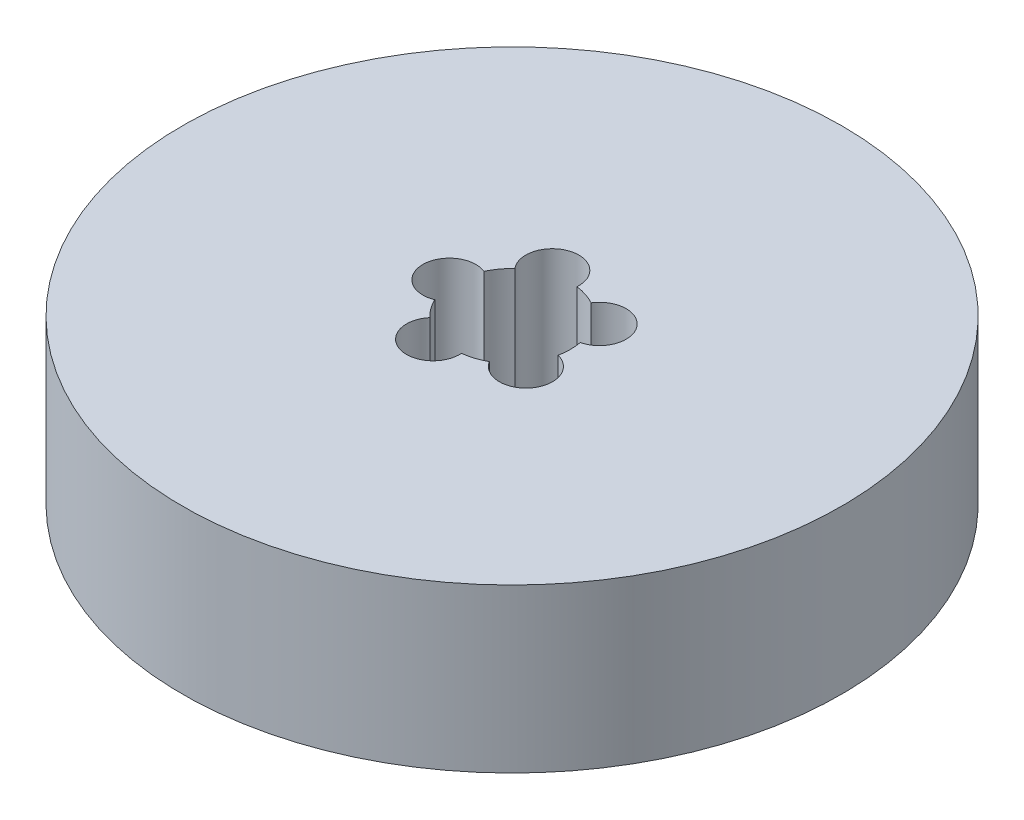
ISO-10303-21;
HEADER;
FILE_DESCRIPTION(('STEP AP214'),'2;1');
FILE_NAME('part.step','',(''),(''),'','','');
FILE_SCHEMA(('AUTOMOTIVE_DESIGN { 1 0 10303 214 1 1 1 1 }'));
ENDSEC;
DATA;
#1=APPLICATION_CONTEXT('core data for automotive mechanical design processes');
#2=APPLICATION_PROTOCOL_DEFINITION('international standard','automotive_design',2000,#1);
#3=PRODUCT_CONTEXT('',#1,'mechanical');
#4=PRODUCT('Part','Part','',(#3));
#5=PRODUCT_RELATED_PRODUCT_CATEGORY('part','',(#4));
#6=PRODUCT_DEFINITION_FORMATION('','',#4);
#7=PRODUCT_DEFINITION_CONTEXT('part definition',#1,'design');
#8=PRODUCT_DEFINITION('design','',#6,#7);
#9=PRODUCT_DEFINITION_SHAPE('','',#8);
#10=(LENGTH_UNIT() NAMED_UNIT(*) SI_UNIT(.MILLI.,.METRE.));
#11=(NAMED_UNIT(*) PLANE_ANGLE_UNIT() SI_UNIT($,.RADIAN.));
#12=(NAMED_UNIT(*) SI_UNIT($,.STERADIAN.) SOLID_ANGLE_UNIT());
#13=UNCERTAINTY_MEASURE_WITH_UNIT(LENGTH_MEASURE(1.E-05),#10,'distance_accuracy_value','');
#14=(GEOMETRIC_REPRESENTATION_CONTEXT(3) GLOBAL_UNCERTAINTY_ASSIGNED_CONTEXT((#13)) GLOBAL_UNIT_ASSIGNED_CONTEXT((#10,
#11,#12)) REPRESENTATION_CONTEXT('',''));
#15=CARTESIAN_POINT('',(0.,0.,0.));
#16=DIRECTION('',(0.,0.,1.));
#17=DIRECTION('',(1.,0.,0.));
#18=AXIS2_PLACEMENT_3D('',#15,#16,#17);
#19=CARTESIAN_POINT('',(0.,21.,0.));
#20=DIRECTION('',(0.,-1.,0.));
#21=DIRECTION('',(0.,0.,-1.));
#22=AXIS2_PLACEMENT_3D('',#19,#20,#21);
#23=CYLINDRICAL_SURFACE('',#22,42.5);
#24=CARTESIAN_POINT('',(0.,21.,0.));
#25=DIRECTION('',(0.,1.,0.));
#26=DIRECTION('',(0.,0.,1.));
#27=AXIS2_PLACEMENT_3D('',#24,#25,#26);
#28=CIRCLE('',#27,42.5);
#29=CARTESIAN_POINT('',(0.,21.,-42.5));
#30=VERTEX_POINT('',#29);
#31=EDGE_CURVE('E157',#30,#30,#28,.T.);
#32=CARTESIAN_POINT('',(0.,0.,0.));
#33=DIRECTION('',(0.,1.,0.));
#34=DIRECTION('',(0.,0.,1.));
#35=AXIS2_PLACEMENT_3D('',#32,#33,#34);
#36=CIRCLE('',#35,42.5);
#37=CARTESIAN_POINT('',(0.,0.,-42.5));
#38=VERTEX_POINT('',#37);
#39=EDGE_CURVE('E150',#38,#38,#36,.T.);
#40=CARTESIAN_POINT('',(0.,21.,-42.5));
#41=CARTESIAN_POINT('',(0.,20.78125,-42.5));
#42=CARTESIAN_POINT('',(0.,20.5625,-42.5));
#43=CARTESIAN_POINT('',(0.,20.125,-42.5));
#44=CARTESIAN_POINT('',(0.,19.90625,-42.5));
#45=CARTESIAN_POINT('',(0.,19.46875,-42.5));
#46=CARTESIAN_POINT('',(0.,19.25,-42.5));
#47=CARTESIAN_POINT('',(0.,18.8125,-42.5));
#48=CARTESIAN_POINT('',(0.,18.59375,-42.5));
#49=CARTESIAN_POINT('',(0.,18.15625,-42.5));
#50=CARTESIAN_POINT('',(0.,17.9375,-42.5));
#51=CARTESIAN_POINT('',(0.,17.5,-42.5));
#52=CARTESIAN_POINT('',(0.,17.28125,-42.5));
#53=CARTESIAN_POINT('',(0.,16.84375,-42.5));
#54=CARTESIAN_POINT('',(0.,16.625,-42.5));
#55=CARTESIAN_POINT('',(0.,16.1875,-42.5));
#56=CARTESIAN_POINT('',(0.,15.96875,-42.5));
#57=CARTESIAN_POINT('',(0.,15.53125,-42.5));
#58=CARTESIAN_POINT('',(0.,15.3125,-42.5));
#59=CARTESIAN_POINT('',(0.,14.875,-42.5));
#60=CARTESIAN_POINT('',(0.,14.65625,-42.5));
#61=CARTESIAN_POINT('',(0.,14.21875,-42.5));
#62=CARTESIAN_POINT('',(0.,14.,-42.5));
#63=CARTESIAN_POINT('',(0.,13.5625,-42.5));
#64=CARTESIAN_POINT('',(0.,13.34375,-42.5));
#65=CARTESIAN_POINT('',(0.,12.90625,-42.5));
#66=CARTESIAN_POINT('',(0.,12.6875,-42.5));
#67=CARTESIAN_POINT('',(0.,12.25,-42.5));
#68=CARTESIAN_POINT('',(0.,12.03125,-42.5));
#69=CARTESIAN_POINT('',(0.,11.59375,-42.5));
#70=CARTESIAN_POINT('',(0.,11.375,-42.5));
#71=CARTESIAN_POINT('',(0.,10.9375,-42.5));
#72=CARTESIAN_POINT('',(0.,10.71875,-42.5));
#73=CARTESIAN_POINT('',(0.,10.28125,-42.5));
#74=CARTESIAN_POINT('',(0.,10.0625,-42.5));
#75=CARTESIAN_POINT('',(0.,9.625,-42.5));
#76=CARTESIAN_POINT('',(0.,9.40625,-42.5));
#77=CARTESIAN_POINT('',(0.,8.96875,-42.5));
#78=CARTESIAN_POINT('',(0.,8.75,-42.5));
#79=CARTESIAN_POINT('',(0.,8.3125,-42.5));
#80=CARTESIAN_POINT('',(0.,8.09375,-42.5));
#81=CARTESIAN_POINT('',(0.,7.65625,-42.5));
#82=CARTESIAN_POINT('',(0.,7.4375,-42.5));
#83=CARTESIAN_POINT('',(0.,7.,-42.5));
#84=CARTESIAN_POINT('',(0.,6.78125,-42.5));
#85=CARTESIAN_POINT('',(0.,6.34375,-42.5));
#86=CARTESIAN_POINT('',(0.,6.125,-42.5));
#87=CARTESIAN_POINT('',(0.,5.6875,-42.5));
#88=CARTESIAN_POINT('',(0.,5.46875,-42.5));
#89=CARTESIAN_POINT('',(0.,5.03125,-42.5));
#90=CARTESIAN_POINT('',(0.,4.8125,-42.5));
#91=CARTESIAN_POINT('',(0.,4.375,-42.5));
#92=CARTESIAN_POINT('',(0.,4.15625,-42.5));
#93=CARTESIAN_POINT('',(0.,3.71875,-42.5));
#94=CARTESIAN_POINT('',(0.,3.5,-42.5));
#95=CARTESIAN_POINT('',(0.,3.0625,-42.5));
#96=CARTESIAN_POINT('',(0.,2.84375,-42.5));
#97=CARTESIAN_POINT('',(0.,2.40625,-42.5));
#98=CARTESIAN_POINT('',(0.,2.1875,-42.5));
#99=CARTESIAN_POINT('',(0.,1.75,-42.5));
#100=CARTESIAN_POINT('',(0.,1.53125,-42.5));
#101=CARTESIAN_POINT('',(0.,1.09375,-42.5));
#102=CARTESIAN_POINT('',(0.,0.875000000000001,-42.5));
#103=CARTESIAN_POINT('',(0.,0.4375,-42.5));
#104=CARTESIAN_POINT('',(0.,0.21875,-42.5));
#105=CARTESIAN_POINT('',(0.,0.,-42.5));
#106=B_SPLINE_CURVE_WITH_KNOTS('',3,(#40,#41,#42,#43,#44,#45,#46,#47,#48,#49,#50,#51,#52,#53,
#54,#55,#56,#57,#58,#59,#60,#61,#62,#63,#64,#65,#66,#67,#68,#69,#70,#71,#72,#73,#74,#75,#76,#77,
#78,#79,#80,#81,#82,#83,#84,#85,#86,#87,#88,#89,#90,#91,#92,#93,#94,#95,#96,#97,#98,#99,#100,
#101,#102,#103,#104,#105),.UNSPECIFIED.,.F.,.F.,(4,2,2,2,2,2,2,2,2,2,2,2,2,2,2,2,2,2,2,2,2,2,2,
2,2,2,2,2,2,2,2,2,4),(0.,0.656249999999997,1.3125,1.96875,2.625,3.28125,3.9375,4.59375,5.25,
5.90625,6.5625,7.21875,7.875,8.53125,9.1875,9.84375,10.5,11.15625,11.8125,12.46875,13.125,
13.78125,14.4375,15.09375,15.75,16.40625,17.0625,17.71875,18.375,19.03125,19.6875,20.34375,21.),.UNSPECIFIED.);
#107=EDGE_CURVE('BSEAM39',#30,#38,#106,.T.);
#108=ORIENTED_EDGE('',*,*,#31,.F.);
#109=ORIENTED_EDGE('',*,*,#39,.T.);
#110=ORIENTED_EDGE('',*,*,#107,.T.);
#111=ORIENTED_EDGE('',*,*,#107,.F.);
#112=EDGE_LOOP('',(#108,#110,#109,#111));
#113=FACE_BOUND('',#112,.T.);
#114=ADVANCED_FACE('F39',(#113),#23,.T.);
#115=CARTESIAN_POINT('',(0.,21.,0.));
#116=DIRECTION('',(0.,1.,0.));
#117=DIRECTION('',(0.,0.,1.));
#118=AXIS2_PLACEMENT_3D('',#115,#116,#117);
#119=PLANE('',#118);
#120=CARTESIAN_POINT('',(-2.49709164612826,21.,-7.68525785010649));
#121=DIRECTION('',(0.,1.,0.));
#122=DIRECTION('',(-0.95105651629515,0.,0.309016994374958));
#123=AXIS2_PLACEMENT_3D('',#120,#121,#122);
#124=CIRCLE('',#123,3.42428657281927);
#125=CARTESIAN_POINT('',(0.918651936595662,21.,-7.44352595343021));
#126=VERTEX_POINT('',#125);
#127=CARTESIAN_POINT('',(-5.11839980910402,21.,-5.48196893407505));
#128=VERTEX_POINT('',#127);
#129=EDGE_CURVE('E194',#126,#128,#124,.T.);
#130=ORIENTED_EDGE('',*,*,#129,.F.);
#131=CARTESIAN_POINT('',(0.,21.,0.));
#132=DIRECTION('',(0.,1.,0.));
#133=DIRECTION('',(0.,0.,1.));
#134=AXIS2_PLACEMENT_3D('',#131,#132,#133);
#135=CIRCLE('',#134,7.5);
#136=CARTESIAN_POINT('',(3.63198975186106,21.,-6.56190905471694));
#137=VERTEX_POINT('',#136);
#138=EDGE_CURVE('E147',#137,#126,#135,.T.);
#139=ORIENTED_EDGE('',*,*,#138,.F.);
#140=CARTESIAN_POINT('',(6.53747080258693,21.,-4.74975056367283));
#141=DIRECTION('',(0.,1.,0.));
#142=DIRECTION('',(-0.58778525229248,0.,-0.809016994374942));
#143=AXIS2_PLACEMENT_3D('',#140,#141,#142);
#144=CIRCLE('',#143,3.42428657281927);
#145=CARTESIAN_POINT('',(7.36309292254541,21.,-1.42648610717443));
#146=VERTEX_POINT('',#145);
#147=EDGE_CURVE('E254',#146,#137,#144,.T.);
#148=ORIENTED_EDGE('',*,*,#147,.F.);
#149=CARTESIAN_POINT('',(7.36309292254543,21.,1.42648610717432));
#150=VERTEX_POINT('',#149);
#151=EDGE_CURVE('E144',#150,#146,#135,.T.);
#152=ORIENTED_EDGE('',*,*,#151,.F.);
#153=CARTESIAN_POINT('',(6.537470802587,21.,4.74975056367274));
#154=DIRECTION('',(0.,1.,0.));
#155=DIRECTION('',(0.587785252292469,0.,-0.809016994374951));
#156=AXIS2_PLACEMENT_3D('',#153,#154,#155);
#157=CIRCLE('',#156,3.42428657281927);
#158=CARTESIAN_POINT('',(3.63198975186116,21.,6.56190905471689));
#159=VERTEX_POINT('',#158);
#160=EDGE_CURVE('E141',#159,#150,#157,.T.);
#161=ORIENTED_EDGE('',*,*,#160,.F.);
#162=CARTESIAN_POINT('',(0.918651936595767,21.,7.44352595343019));
#163=VERTEX_POINT('',#162);
#164=EDGE_CURVE('E134',#163,#159,#135,.T.);
#165=ORIENTED_EDGE('',*,*,#164,.F.);
#166=CARTESIAN_POINT('',(-2.49709164612815,21.,7.68525785010653));
#167=DIRECTION('',(0.,1.,0.));
#168=DIRECTION('',(0.951056516295155,0.,0.309016994374945));
#169=AXIS2_PLACEMENT_3D('',#166,#167,#168);
#170=CIRCLE('',#169,3.42428657281927);
#171=CARTESIAN_POINT('',(-5.11839980910394,21.,5.48196893407512));
#172=VERTEX_POINT('',#171);
#173=EDGE_CURVE('E111',#172,#163,#170,.T.);
#174=ORIENTED_EDGE('',*,*,#173,.F.);
#175=CARTESIAN_POINT('',(-6.79533480189834,21.,3.17386592818746));
#176=VERTEX_POINT('',#175);
#177=EDGE_CURVE('E145',#176,#172,#135,.T.);
#178=ORIENTED_EDGE('',*,*,#177,.F.);
#179=CARTESIAN_POINT('',(-8.08075831291761,21.,0.));
#180=DIRECTION('',(0.,1.,0.));
#181=DIRECTION('',(0.,0.,1.));
#182=AXIS2_PLACEMENT_3D('',#179,#180,#181);
#183=CIRCLE('',#182,3.42428657281927);
#184=CARTESIAN_POINT('',(-6.79533480189834,21.,-3.17386592818746));
#185=VERTEX_POINT('',#184);
#186=EDGE_CURVE('E153',#185,#176,#183,.T.);
#187=ORIENTED_EDGE('',*,*,#186,.F.);
#188=EDGE_CURVE('E146',#128,#185,#135,.T.);
#189=ORIENTED_EDGE('',*,*,#188,.F.);
#190=EDGE_LOOP('',(#130,#139,#148,#152,#161,#165,#174,#178,#187,#189));
#191=FACE_BOUND('',#190,.T.);
#192=ORIENTED_EDGE('',*,*,#31,.T.);
#193=EDGE_LOOP('',(#192));
#194=FACE_BOUND('',#193,.T.);
#195=ADVANCED_FACE('F139',(#191,#194),#119,.T.);
#196=CARTESIAN_POINT('',(0.,0.,0.));
#197=DIRECTION('',(0.,1.,0.));
#198=DIRECTION('',(0.,0.,1.));
#199=AXIS2_PLACEMENT_3D('',#196,#197,#198);
#200=PLANE('',#199);
#201=CARTESIAN_POINT('',(0.,0.,0.));
#202=DIRECTION('',(0.,1.,0.));
#203=DIRECTION('',(0.,0.,1.));
#204=AXIS2_PLACEMENT_3D('',#201,#202,#203);
#205=CIRCLE('',#204,7.5);
#206=CARTESIAN_POINT('',(0.,0.,7.5));
#207=VERTEX_POINT('',#206);
#208=EDGE_CURVE('E154',#207,#207,#205,.T.);
#209=ORIENTED_EDGE('',*,*,#208,.T.);
#210=EDGE_LOOP('',(#209));
#211=FACE_BOUND('',#210,.T.);
#212=ORIENTED_EDGE('',*,*,#39,.F.);
#213=EDGE_LOOP('',(#212));
#214=FACE_BOUND('',#213,.T.);
#215=ADVANCED_FACE('F213',(#211,#214),#200,.F.);
#216=CARTESIAN_POINT('',(0.,21.,0.));
#217=DIRECTION('',(0.,-1.,0.));
#218=DIRECTION('',(0.,0.,-1.));
#219=AXIS2_PLACEMENT_3D('',#216,#217,#218);
#220=CYLINDRICAL_SURFACE('',#219,7.5);
#221=DIRECTION('',(0.,1.,0.));
#222=VECTOR('',#221,1.);
#223=CARTESIAN_POINT('',(0.918651936595663,11.2445267197907,-7.44352595343021));
#224=LINE('',#223,#222);
#225=CARTESIAN_POINT('',(0.918651936595662,1.48905343958139,-7.44352595343021));
#226=VERTEX_POINT('',#225);
#227=EDGE_CURVE('E11',#226,#126,#224,.T.);
#228=ORIENTED_EDGE('',*,*,#227,.F.);
#229=CARTESIAN_POINT('',(0.,1.48905343958139,0.));
#230=DIRECTION('',(0.,1.,0.));
#231=DIRECTION('',(0.,0.,1.));
#232=AXIS2_PLACEMENT_3D('',#229,#230,#231);
#233=CIRCLE('',#232,7.5);
#234=CARTESIAN_POINT('',(-5.11839980910402,1.48905343958139,-5.48196893407505));
#235=VERTEX_POINT('',#234);
#236=EDGE_CURVE('E189',#226,#235,#233,.T.);
#237=ORIENTED_EDGE('',*,*,#236,.T.);
#238=DIRECTION('',(0.,1.,0.));
#239=VECTOR('',#238,1.);
#240=CARTESIAN_POINT('',(-5.11839980910402,11.2445267197907,-5.48196893407505));
#241=LINE('',#240,#239);
#242=EDGE_CURVE('E46',#128,#235,#241,.F.);
#243=ORIENTED_EDGE('',*,*,#242,.F.);
#244=ORIENTED_EDGE('',*,*,#188,.T.);
#245=DIRECTION('',(0.,1.,0.));
#246=VECTOR('',#245,1.);
#247=CARTESIAN_POINT('',(-6.79533480189834,11.2445267197907,-3.17386592818746));
#248=LINE('',#247,#246);
#249=CARTESIAN_POINT('',(-6.79533480189834,1.48905343958139,-3.17386592818746));
#250=VERTEX_POINT('',#249);
#251=EDGE_CURVE('E168',#250,#185,#248,.T.);
#252=ORIENTED_EDGE('',*,*,#251,.F.);
#253=CARTESIAN_POINT('',(0.,1.48905343958139,0.));
#254=DIRECTION('',(0.,1.,0.));
#255=DIRECTION('',(0.,0.,1.));
#256=AXIS2_PLACEMENT_3D('',#253,#254,#255);
#257=CIRCLE('',#256,7.5);
#258=CARTESIAN_POINT('',(-6.79533480189834,1.48905343958139,3.17386592818746));
#259=VERTEX_POINT('',#258);
#260=EDGE_CURVE('E165',#250,#259,#257,.T.);
#261=ORIENTED_EDGE('',*,*,#260,.T.);
#262=DIRECTION('',(0.,1.,0.));
#263=VECTOR('',#262,1.);
#264=CARTESIAN_POINT('',(-6.79533480189834,11.2445267197907,3.17386592818746));
#265=LINE('',#264,#263);
#266=EDGE_CURVE('E170',#176,#259,#265,.F.);
#267=ORIENTED_EDGE('',*,*,#266,.F.);
#268=ORIENTED_EDGE('',*,*,#177,.T.);
#269=DIRECTION('',(0.,1.,0.));
#270=VECTOR('',#269,1.);
#271=CARTESIAN_POINT('',(-5.11839980910394,11.2445267197907,5.48196893407512));
#272=LINE('',#271,#270);
#273=CARTESIAN_POINT('',(-5.11839980910394,1.48905343958139,5.48196893407512));
#274=VERTEX_POINT('',#273);
#275=EDGE_CURVE('E121',#274,#172,#272,.T.);
#276=ORIENTED_EDGE('',*,*,#275,.F.);
#277=CARTESIAN_POINT('',(0.,1.48905343958139,0.));
#278=DIRECTION('',(0.,1.,0.));
#279=DIRECTION('',(0.,0.,1.));
#280=AXIS2_PLACEMENT_3D('',#277,#278,#279);
#281=CIRCLE('',#280,7.5);
#282=CARTESIAN_POINT('',(0.918651936595767,1.48905343958139,7.44352595343019));
#283=VERTEX_POINT('',#282);
#284=EDGE_CURVE('E136',#274,#283,#281,.T.);
#285=ORIENTED_EDGE('',*,*,#284,.T.);
#286=DIRECTION('',(0.,1.,0.));
#287=VECTOR('',#286,1.);
#288=CARTESIAN_POINT('',(0.918651936595768,11.2445267197907,7.44352595343019));
#289=LINE('',#288,#287);
#290=EDGE_CURVE('E117',#163,#283,#289,.F.);
#291=ORIENTED_EDGE('',*,*,#290,.F.);
#292=ORIENTED_EDGE('',*,*,#164,.T.);
#293=DIRECTION('',(0.,1.,0.));
#294=VECTOR('',#293,1.);
#295=CARTESIAN_POINT('',(3.63198975186116,11.2445267197907,6.56190905471689));
#296=LINE('',#295,#294);
#297=CARTESIAN_POINT('',(3.63198975186116,1.48905343958139,6.56190905471689));
#298=VERTEX_POINT('',#297);
#299=EDGE_CURVE('E182',#298,#159,#296,.T.);
#300=ORIENTED_EDGE('',*,*,#299,.F.);
#301=CARTESIAN_POINT('',(0.,1.48905343958139,0.));
#302=DIRECTION('',(0.,1.,0.));
#303=DIRECTION('',(0.,0.,1.));
#304=AXIS2_PLACEMENT_3D('',#301,#302,#303);
#305=CIRCLE('',#304,7.5);
#306=CARTESIAN_POINT('',(7.36309292254543,1.48905343958139,1.42648610717432));
#307=VERTEX_POINT('',#306);
#308=EDGE_CURVE('E174',#298,#307,#305,.T.);
#309=ORIENTED_EDGE('',*,*,#308,.T.);
#310=DIRECTION('',(0.,1.,0.));
#311=VECTOR('',#310,1.);
#312=CARTESIAN_POINT('',(7.36309292254543,11.2445267197907,1.42648610717432));
#313=LINE('',#312,#311);
#314=EDGE_CURVE('E177',#150,#307,#313,.F.);
#315=ORIENTED_EDGE('',*,*,#314,.F.);
#316=ORIENTED_EDGE('',*,*,#151,.T.);
#317=DIRECTION('',(0.,1.,0.));
#318=VECTOR('',#317,1.);
#319=CARTESIAN_POINT('',(7.36309292254541,11.2445267197907,-1.42648610717443));
#320=LINE('',#319,#318);
#321=CARTESIAN_POINT('',(7.36309292254541,1.48905343958139,-1.42648610717443));
#322=VERTEX_POINT('',#321);
#323=EDGE_CURVE('E187',#322,#146,#320,.T.);
#324=ORIENTED_EDGE('',*,*,#323,.F.);
#325=CARTESIAN_POINT('',(0.,1.48905343958139,0.));
#326=DIRECTION('',(0.,1.,0.));
#327=DIRECTION('',(0.,0.,1.));
#328=AXIS2_PLACEMENT_3D('',#325,#326,#327);
#329=CIRCLE('',#328,7.5);
#330=CARTESIAN_POINT('',(3.63198975186106,1.48905343958139,-6.56190905471694));
#331=VERTEX_POINT('',#330);
#332=EDGE_CURVE('E181',#322,#331,#329,.T.);
#333=ORIENTED_EDGE('',*,*,#332,.T.);
#334=DIRECTION('',(0.,1.,0.));
#335=VECTOR('',#334,1.);
#336=CARTESIAN_POINT('',(3.63198975186106,11.2445267197907,-6.56190905471694));
#337=LINE('',#336,#335);
#338=EDGE_CURVE('E186',#137,#331,#337,.F.);
#339=ORIENTED_EDGE('',*,*,#338,.F.);
#340=ORIENTED_EDGE('',*,*,#138,.T.);
#341=EDGE_LOOP('',(#228,#237,#243,#244,#252,#261,#267,#268,#276,#285,#291,#292,#300,#309,#315,
#316,#324,#333,#339,#340));
#342=FACE_BOUND('',#341,.T.);
#343=ORIENTED_EDGE('',*,*,#208,.F.);
#344=EDGE_LOOP('',(#343));
#345=FACE_BOUND('',#344,.T.);
#346=ADVANCED_FACE('F135',(#342,#345),#220,.F.);
#347=CARTESIAN_POINT('',(-8.08075831291761,1.48905343958139,0.));
#348=DIRECTION('',(0.,1.,0.));
#349=DIRECTION('',(0.,0.,1.));
#350=AXIS2_PLACEMENT_3D('',#347,#348,#349);
#351=CYLINDRICAL_SURFACE('',#350,3.42428657281927);
#352=ORIENTED_EDGE('',*,*,#251,.T.);
#353=ORIENTED_EDGE('',*,*,#186,.T.);
#354=ORIENTED_EDGE('',*,*,#266,.T.);
#355=CARTESIAN_POINT('',(-8.08075831291761,1.48905343958139,0.));
#356=DIRECTION('',(0.,1.,0.));
#357=DIRECTION('',(0.,0.,1.));
#358=AXIS2_PLACEMENT_3D('',#355,#356,#357);
#359=CIRCLE('',#358,3.42428657281927);
#360=EDGE_CURVE('E158',#250,#259,#359,.T.);
#361=ORIENTED_EDGE('',*,*,#360,.F.);
#362=EDGE_LOOP('',(#352,#353,#354,#361));
#363=FACE_BOUND('',#362,.T.);
#364=ADVANCED_FACE('F221',(#363),#351,.F.);
#365=CARTESIAN_POINT('',(-8.08075831291761,1.48905343958139,0.));
#366=DIRECTION('',(0.,1.,0.));
#367=DIRECTION('',(0.,0.,1.));
#368=AXIS2_PLACEMENT_3D('',#365,#366,#367);
#369=PLANE('',#368);
#370=ORIENTED_EDGE('',*,*,#360,.T.);
#371=ORIENTED_EDGE('',*,*,#260,.F.);
#372=EDGE_LOOP('',(#370,#371));
#373=FACE_BOUND('',#372,.T.);
#374=ADVANCED_FACE('F227',(#373),#369,.T.);
#375=CARTESIAN_POINT('',(-2.49709164612815,1.48905343958139,7.68525785010653));
#376=DIRECTION('',(0.,1.,0.));
#377=DIRECTION('',(0.,0.,1.));
#378=AXIS2_PLACEMENT_3D('',#375,#376,#377);
#379=CYLINDRICAL_SURFACE('',#378,3.42428657281927);
#380=ORIENTED_EDGE('',*,*,#275,.T.);
#381=ORIENTED_EDGE('',*,*,#173,.T.);
#382=ORIENTED_EDGE('',*,*,#290,.T.);
#383=CARTESIAN_POINT('',(-2.49709164612815,1.48905343958139,7.68525785010653));
#384=DIRECTION('',(0.,1.,0.));
#385=DIRECTION('',(0.951056516295155,0.,0.309016994374945));
#386=AXIS2_PLACEMENT_3D('',#383,#384,#385);
#387=CIRCLE('',#386,3.42428657281927);
#388=EDGE_CURVE('E127',#274,#283,#387,.T.);
#389=ORIENTED_EDGE('',*,*,#388,.F.);
#390=EDGE_LOOP('',(#380,#381,#382,#389));
#391=FACE_BOUND('',#390,.T.);
#392=ADVANCED_FACE('F116',(#391),#379,.F.);
#393=CARTESIAN_POINT('',(-2.49709164612815,1.48905343958139,7.68525785010653));
#394=DIRECTION('',(0.,1.,0.));
#395=DIRECTION('',(0.951056516295155,0.,0.309016994374945));
#396=AXIS2_PLACEMENT_3D('',#393,#394,#395);
#397=PLANE('',#396);
#398=ORIENTED_EDGE('',*,*,#388,.T.);
#399=ORIENTED_EDGE('',*,*,#284,.F.);
#400=EDGE_LOOP('',(#398,#399));
#401=FACE_BOUND('',#400,.T.);
#402=ADVANCED_FACE('F234',(#401),#397,.T.);
#403=CARTESIAN_POINT('',(6.537470802587,1.48905343958139,4.74975056367274));
#404=DIRECTION('',(0.,1.,0.));
#405=DIRECTION('',(0.,0.,1.));
#406=AXIS2_PLACEMENT_3D('',#403,#404,#405);
#407=CYLINDRICAL_SURFACE('',#406,3.42428657281927);
#408=ORIENTED_EDGE('',*,*,#299,.T.);
#409=ORIENTED_EDGE('',*,*,#160,.T.);
#410=ORIENTED_EDGE('',*,*,#314,.T.);
#411=CARTESIAN_POINT('',(6.537470802587,1.48905343958139,4.74975056367274));
#412=DIRECTION('',(0.,1.,0.));
#413=DIRECTION('',(0.587785252292469,0.,-0.809016994374951));
#414=AXIS2_PLACEMENT_3D('',#411,#412,#413);
#415=CIRCLE('',#414,3.42428657281927);
#416=EDGE_CURVE('E130',#298,#307,#415,.T.);
#417=ORIENTED_EDGE('',*,*,#416,.F.);
#418=EDGE_LOOP('',(#408,#409,#410,#417));
#419=FACE_BOUND('',#418,.T.);
#420=ADVANCED_FACE('F240',(#419),#407,.F.);
#421=CARTESIAN_POINT('',(6.537470802587,1.48905343958139,4.74975056367274));
#422=DIRECTION('',(0.,1.,0.));
#423=DIRECTION('',(0.587785252292469,0.,-0.809016994374951));
#424=AXIS2_PLACEMENT_3D('',#421,#422,#423);
#425=PLANE('',#424);
#426=ORIENTED_EDGE('',*,*,#416,.T.);
#427=ORIENTED_EDGE('',*,*,#308,.F.);
#428=EDGE_LOOP('',(#426,#427));
#429=FACE_BOUND('',#428,.T.);
#430=ADVANCED_FACE('F245',(#429),#425,.T.);
#431=CARTESIAN_POINT('',(6.53747080258693,1.48905343958139,-4.74975056367283));
#432=DIRECTION('',(0.,1.,0.));
#433=DIRECTION('',(0.,0.,1.));
#434=AXIS2_PLACEMENT_3D('',#431,#432,#433);
#435=CYLINDRICAL_SURFACE('',#434,3.42428657281927);
#436=ORIENTED_EDGE('',*,*,#323,.T.);
#437=ORIENTED_EDGE('',*,*,#147,.T.);
#438=ORIENTED_EDGE('',*,*,#338,.T.);
#439=CARTESIAN_POINT('',(6.53747080258693,1.48905343958139,-4.74975056367283));
#440=DIRECTION('',(0.,1.,0.));
#441=DIRECTION('',(-0.58778525229248,0.,-0.809016994374942));
#442=AXIS2_PLACEMENT_3D('',#439,#440,#441);
#443=CIRCLE('',#442,3.42428657281927);
#444=EDGE_CURVE('E56',#322,#331,#443,.T.);
#445=ORIENTED_EDGE('',*,*,#444,.F.);
#446=EDGE_LOOP('',(#436,#437,#438,#445));
#447=FACE_BOUND('',#446,.T.);
#448=ADVANCED_FACE('F266',(#447),#435,.F.);
#449=CARTESIAN_POINT('',(6.53747080258693,1.48905343958139,-4.74975056367283));
#450=DIRECTION('',(0.,1.,0.));
#451=DIRECTION('',(-0.58778525229248,0.,-0.809016994374942));
#452=AXIS2_PLACEMENT_3D('',#449,#450,#451);
#453=PLANE('',#452);
#454=ORIENTED_EDGE('',*,*,#444,.T.);
#455=ORIENTED_EDGE('',*,*,#332,.F.);
#456=EDGE_LOOP('',(#454,#455));
#457=FACE_BOUND('',#456,.T.);
#458=ADVANCED_FACE('F204',(#457),#453,.T.);
#459=CARTESIAN_POINT('',(-2.49709164612826,1.48905343958139,-7.68525785010649));
#460=DIRECTION('',(0.,1.,0.));
#461=DIRECTION('',(0.,0.,1.));
#462=AXIS2_PLACEMENT_3D('',#459,#460,#461);
#463=CYLINDRICAL_SURFACE('',#462,3.42428657281927);
#464=ORIENTED_EDGE('',*,*,#227,.T.);
#465=ORIENTED_EDGE('',*,*,#129,.T.);
#466=ORIENTED_EDGE('',*,*,#242,.T.);
#467=CARTESIAN_POINT('',(-2.49709164612826,1.48905343958139,-7.68525785010649));
#468=DIRECTION('',(0.,1.,0.));
#469=DIRECTION('',(-0.95105651629515,0.,0.309016994374958));
#470=AXIS2_PLACEMENT_3D('',#467,#468,#469);
#471=CIRCLE('',#470,3.42428657281927);
#472=EDGE_CURVE('E55',#226,#235,#471,.T.);
#473=ORIENTED_EDGE('',*,*,#472,.F.);
#474=EDGE_LOOP('',(#464,#465,#466,#473));
#475=FACE_BOUND('',#474,.T.);
#476=ADVANCED_FACE('F193',(#475),#463,.F.);
#477=CARTESIAN_POINT('',(-2.49709164612826,1.48905343958139,-7.68525785010649));
#478=DIRECTION('',(0.,1.,0.));
#479=DIRECTION('',(-0.95105651629515,0.,0.309016994374958));
#480=AXIS2_PLACEMENT_3D('',#477,#478,#479);
#481=PLANE('',#480);
#482=ORIENTED_EDGE('',*,*,#472,.T.);
#483=ORIENTED_EDGE('',*,*,#236,.F.);
#484=EDGE_LOOP('',(#482,#483));
#485=FACE_BOUND('',#484,.T.);
#486=ADVANCED_FACE('F196',(#485),#481,.T.);
#487=CLOSED_SHELL('',(#114,#195,#215,#346,#364,#374,#392,#402,#420,#430,#448,#458,#476,#486));
#488=MANIFOLD_SOLID_BREP('B2',#487);
#489=ADVANCED_BREP_SHAPE_REPRESENTATION('',(#18,#488),#14);
#490=SHAPE_DEFINITION_REPRESENTATION(#9,#489);
ENDSEC;
END-ISO-10303-21;
